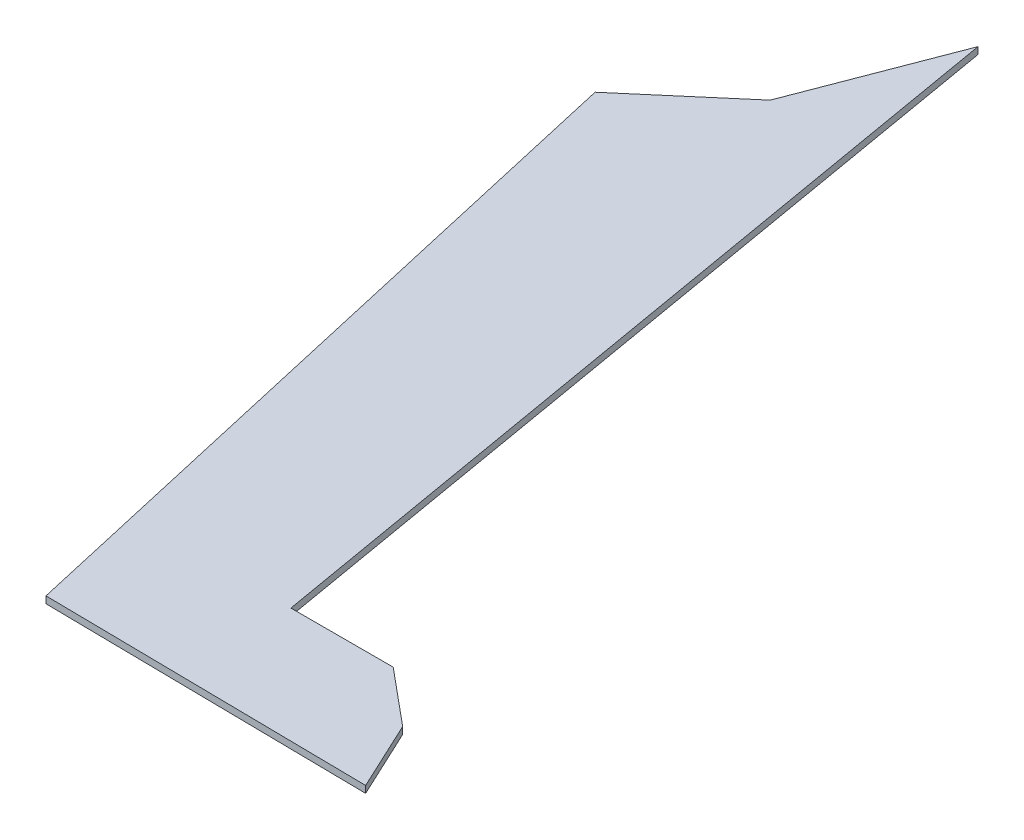
ISO-10303-21;
HEADER;
FILE_DESCRIPTION(('STEP AP214'),'2;1');
FILE_NAME('part.step','',(''),(''),'','','');
FILE_SCHEMA(('AUTOMOTIVE_DESIGN { 1 0 10303 214 1 1 1 1 }'));
ENDSEC;
DATA;
#1=APPLICATION_CONTEXT('core data for automotive mechanical design processes');
#2=APPLICATION_PROTOCOL_DEFINITION('international standard','automotive_design',2000,#1);
#3=PRODUCT_CONTEXT('',#1,'mechanical');
#4=PRODUCT('Part','Part','',(#3));
#5=PRODUCT_RELATED_PRODUCT_CATEGORY('part','',(#4));
#6=PRODUCT_DEFINITION_FORMATION('','',#4);
#7=PRODUCT_DEFINITION_CONTEXT('part definition',#1,'design');
#8=PRODUCT_DEFINITION('design','',#6,#7);
#9=PRODUCT_DEFINITION_SHAPE('','',#8);
#10=(LENGTH_UNIT() NAMED_UNIT(*) SI_UNIT(.MILLI.,.METRE.));
#11=(NAMED_UNIT(*) PLANE_ANGLE_UNIT() SI_UNIT($,.RADIAN.));
#12=(NAMED_UNIT(*) SI_UNIT($,.STERADIAN.) SOLID_ANGLE_UNIT());
#13=UNCERTAINTY_MEASURE_WITH_UNIT(LENGTH_MEASURE(1.E-05),#10,'distance_accuracy_value','');
#14=(GEOMETRIC_REPRESENTATION_CONTEXT(3) GLOBAL_UNCERTAINTY_ASSIGNED_CONTEXT((#13)) GLOBAL_UNIT_ASSIGNED_CONTEXT((#10,
#11,#12)) REPRESENTATION_CONTEXT('',''));
#15=CARTESIAN_POINT('',(0.,0.,0.));
#16=DIRECTION('',(0.,0.,1.));
#17=DIRECTION('',(1.,0.,0.));
#18=AXIS2_PLACEMENT_3D('',#15,#16,#17);
#19=CARTESIAN_POINT('',(84.8611547416434,2.,-18.9767312589499));
#20=DIRECTION('',(-0.639171684388944,0.,0.769064079173771));
#21=DIRECTION('',(0.769064079173771,0.,0.639171684388944));
#22=AXIS2_PLACEMENT_3D('',#19,#20,#21);
#23=PLANE('',#22);
#24=DIRECTION('',(-0.769064079173771,0.,-0.639171684388944));
#25=VECTOR('',#24,1.);
#26=CARTESIAN_POINT('',(84.8611547416434,0.,-18.9767312589499));
#27=LINE('',#26,#25);
#28=CARTESIAN_POINT('',(84.8611547416434,0.,-18.9767312589499));
#29=VERTEX_POINT('',#28);
#30=CARTESIAN_POINT('',(68.5103296907742,0.,-32.5659557097145));
#31=VERTEX_POINT('',#30);
#32=EDGE_CURVE('E140',#29,#31,#27,.T.);
#33=ORIENTED_EDGE('',*,*,#32,.T.);
#34=DIRECTION('',(0.,-1.,0.));
#35=VECTOR('',#34,1.);
#36=CARTESIAN_POINT('',(68.5103296907742,2.,-32.5659557097145));
#37=LINE('',#36,#35);
#38=CARTESIAN_POINT('',(68.5103296907742,2.,-32.5659557097145));
#39=VERTEX_POINT('',#38);
#40=EDGE_CURVE('E11',#39,#31,#37,.T.);
#41=ORIENTED_EDGE('',*,*,#40,.F.);
#42=DIRECTION('',(-0.769064079173771,0.,-0.639171684388944));
#43=VECTOR('',#42,1.);
#44=CARTESIAN_POINT('',(84.8611547416434,2.,-18.9767312589499));
#45=LINE('',#44,#43);
#46=CARTESIAN_POINT('',(84.8611547416434,2.,-18.9767312589499));
#47=VERTEX_POINT('',#46);
#48=EDGE_CURVE('E162',#47,#39,#45,.T.);
#49=ORIENTED_EDGE('',*,*,#48,.F.);
#50=DIRECTION('',(0.,-1.,0.));
#51=VECTOR('',#50,1.);
#52=CARTESIAN_POINT('',(84.8611547416434,2.,-18.9767312589499));
#53=LINE('',#52,#51);
#54=EDGE_CURVE('E136',#47,#29,#53,.T.);
#55=ORIENTED_EDGE('',*,*,#54,.T.);
#56=EDGE_LOOP('',(#33,#41,#49,#55));
#57=FACE_BOUND('',#56,.T.);
#58=ADVANCED_FACE('F39',(#57),#23,.F.);
#59=CARTESIAN_POINT('',(68.5103296907742,2.,-32.5659557097145));
#60=DIRECTION('',(0.,0.,1.));
#61=DIRECTION('',(1.,0.,0.));
#62=AXIS2_PLACEMENT_3D('',#59,#60,#61);
#63=PLANE('',#62);
#64=DIRECTION('',(-1.,0.,0.));
#65=VECTOR('',#64,1.);
#66=CARTESIAN_POINT('',(68.5103296907742,0.,-32.5659557097145));
#67=LINE('',#66,#65);
#68=CARTESIAN_POINT('',(38.7263403193535,0.,-32.5659557097145));
#69=VERTEX_POINT('',#68);
#70=EDGE_CURVE('E144',#31,#69,#67,.T.);
#71=ORIENTED_EDGE('',*,*,#70,.T.);
#72=DIRECTION('',(0.,-1.,0.));
#73=VECTOR('',#72,1.);
#74=CARTESIAN_POINT('',(38.7263403193535,2.,-32.5659557097145));
#75=LINE('',#74,#73);
#76=CARTESIAN_POINT('',(38.7263403193535,2.,-32.5659557097145));
#77=VERTEX_POINT('',#76);
#78=EDGE_CURVE('E48',#77,#69,#75,.T.);
#79=ORIENTED_EDGE('',*,*,#78,.F.);
#80=DIRECTION('',(-1.,0.,0.));
#81=VECTOR('',#80,1.);
#82=CARTESIAN_POINT('',(68.5103296907742,2.,-32.5659557097145));
#83=LINE('',#82,#81);
#84=EDGE_CURVE('E99',#39,#77,#83,.T.);
#85=ORIENTED_EDGE('',*,*,#84,.F.);
#86=ORIENTED_EDGE('',*,*,#40,.T.);
#87=EDGE_LOOP('',(#71,#79,#85,#86));
#88=FACE_BOUND('',#87,.T.);
#89=ADVANCED_FACE('F208',(#88),#63,.F.);
#90=CARTESIAN_POINT('',(38.7263403193535,2.,-32.5659557097145));
#91=DIRECTION('',(-0.985536140125741,0.,0.169465384388838));
#92=DIRECTION('',(0.169465384388838,0.,0.985536140125741));
#93=AXIS2_PLACEMENT_3D('',#90,#91,#92);
#94=PLANE('',#93);
#95=DIRECTION('',(-0.169465384388838,0.,-0.985536140125741));
#96=VECTOR('',#95,1.);
#97=CARTESIAN_POINT('',(38.7263403193535,0.,-32.5659557097145));
#98=LINE('',#97,#96);
#99=CARTESIAN_POINT('',(-2.81215670151834,0.,-274.135584623683));
#100=VERTEX_POINT('',#99);
#101=EDGE_CURVE('E147',#69,#100,#98,.T.);
#102=ORIENTED_EDGE('',*,*,#101,.T.);
#103=DIRECTION('',(0.,-1.,0.));
#104=VECTOR('',#103,1.);
#105=CARTESIAN_POINT('',(-2.81215670151834,2.,-274.135584623683));
#106=LINE('',#105,#104);
#107=CARTESIAN_POINT('',(-2.81215670151834,2.,-274.135584623683));
#108=VERTEX_POINT('',#107);
#109=EDGE_CURVE('E173',#108,#100,#106,.T.);
#110=ORIENTED_EDGE('',*,*,#109,.F.);
#111=DIRECTION('',(-0.169465384388838,0.,-0.985536140125741));
#112=VECTOR('',#111,1.);
#113=CARTESIAN_POINT('',(38.7263403193535,2.,-32.5659557097145));
#114=LINE('',#113,#112);
#115=EDGE_CURVE('E183',#77,#108,#114,.T.);
#116=ORIENTED_EDGE('',*,*,#115,.F.);
#117=ORIENTED_EDGE('',*,*,#78,.T.);
#118=EDGE_LOOP('',(#102,#110,#116,#117));
#119=FACE_BOUND('',#118,.T.);
#120=ADVANCED_FACE('F181',(#119),#94,.F.);
#121=CARTESIAN_POINT('',(-2.81215670151834,2.,-274.135584623683));
#122=DIRECTION('',(0.9338614890941,0.,0.357634896489352));
#123=DIRECTION('',(0.357634896489352,0.,-0.9338614890941));
#124=AXIS2_PLACEMENT_3D('',#121,#122,#123);
#125=PLANE('',#124);
#126=DIRECTION('',(-0.357634896489352,0.,0.933861489094101));
#127=VECTOR('',#126,1.);
#128=CARTESIAN_POINT('',(-2.81215670151834,0.,-274.135584623683));
#129=LINE('',#128,#127);
#130=CARTESIAN_POINT('',(-19.5662351176632,0.,-230.387089240023));
#131=VERTEX_POINT('',#130);
#132=EDGE_CURVE('E150',#100,#131,#129,.T.);
#133=ORIENTED_EDGE('',*,*,#132,.T.);
#134=DIRECTION('',(0.,-1.,0.));
#135=VECTOR('',#134,1.);
#136=CARTESIAN_POINT('',(-19.5662351176632,2.,-230.387089240023));
#137=LINE('',#136,#135);
#138=CARTESIAN_POINT('',(-19.5662351176632,2.,-230.387089240023));
#139=VERTEX_POINT('',#138);
#140=EDGE_CURVE('E169',#139,#131,#137,.T.);
#141=ORIENTED_EDGE('',*,*,#140,.F.);
#142=DIRECTION('',(-0.357634896489352,0.,0.933861489094101));
#143=VECTOR('',#142,1.);
#144=CARTESIAN_POINT('',(-2.81215670151834,2.,-274.135584623683));
#145=LINE('',#144,#143);
#146=EDGE_CURVE('E196',#108,#139,#145,.T.);
#147=ORIENTED_EDGE('',*,*,#146,.F.);
#148=ORIENTED_EDGE('',*,*,#109,.T.);
#149=EDGE_LOOP('',(#133,#141,#147,#148));
#150=FACE_BOUND('',#149,.T.);
#151=ADVANCED_FACE('F191',(#150),#125,.F.);
#152=CARTESIAN_POINT('',(-19.5662351176632,2.,-230.387089240023));
#153=DIRECTION('',(0.649617978151417,0.,0.760260798977867));
#154=DIRECTION('',(0.760260798977867,0.,-0.649617978151417));
#155=AXIS2_PLACEMENT_3D('',#152,#153,#154);
#156=PLANE('',#155);
#157=DIRECTION('',(-0.760260798977867,0.,0.649617978151417));
#158=VECTOR('',#157,1.);
#159=CARTESIAN_POINT('',(-19.5662351176632,0.,-230.387089240023));
#160=LINE('',#159,#158);
#161=CARTESIAN_POINT('',(-47.052202514385,0.,-206.901229398505));
#162=VERTEX_POINT('',#161);
#163=EDGE_CURVE('E153',#131,#162,#160,.T.);
#164=ORIENTED_EDGE('',*,*,#163,.T.);
#165=DIRECTION('',(0.,-1.,0.));
#166=VECTOR('',#165,1.);
#167=CARTESIAN_POINT('',(-47.052202514385,2.,-206.901229398505));
#168=LINE('',#167,#166);
#169=CARTESIAN_POINT('',(-47.052202514385,2.,-206.901229398505));
#170=VERTEX_POINT('',#169);
#171=EDGE_CURVE('E129',#170,#162,#168,.T.);
#172=ORIENTED_EDGE('',*,*,#171,.F.);
#173=DIRECTION('',(-0.760260798977867,0.,0.649617978151417));
#174=VECTOR('',#173,1.);
#175=CARTESIAN_POINT('',(-19.5662351176632,2.,-230.387089240023));
#176=LINE('',#175,#174);
#177=EDGE_CURVE('E118',#139,#170,#176,.T.);
#178=ORIENTED_EDGE('',*,*,#177,.F.);
#179=ORIENTED_EDGE('',*,*,#140,.T.);
#180=EDGE_LOOP('',(#164,#172,#178,#179));
#181=FACE_BOUND('',#180,.T.);
#182=ADVANCED_FACE('F194',(#181),#156,.F.);
#183=CARTESIAN_POINT('',(-47.052202514385,2.,-206.901229398505));
#184=DIRECTION('',(0.975103110966231,0.,-0.221751940203413));
#185=DIRECTION('',(-0.221751940203413,0.,-0.975103110966231));
#186=AXIS2_PLACEMENT_3D('',#183,#184,#185);
#187=PLANE('',#186);
#188=DIRECTION('',(0.221751940203413,0.,0.975103110966231));
#189=VECTOR('',#188,1.);
#190=CARTESIAN_POINT('',(-47.052202514385,0.,-206.901229398505));
#191=LINE('',#190,#189);
#192=CARTESIAN_POINT('',(0.,0.,0.));
#193=VERTEX_POINT('',#192);
#194=EDGE_CURVE('E127',#162,#193,#191,.T.);
#195=ORIENTED_EDGE('',*,*,#194,.T.);
#196=DIRECTION('',(0.,-1.,0.));
#197=VECTOR('',#196,1.);
#198=CARTESIAN_POINT('',(0.,2.,0.));
#199=LINE('',#198,#197);
#200=CARTESIAN_POINT('',(0.,2.,0.));
#201=VERTEX_POINT('',#200);
#202=EDGE_CURVE('E124',#201,#193,#199,.T.);
#203=ORIENTED_EDGE('',*,*,#202,.F.);
#204=DIRECTION('',(0.221751940203413,0.,0.975103110966231));
#205=VECTOR('',#204,1.);
#206=CARTESIAN_POINT('',(-47.052202514385,2.,-206.901229398505));
#207=LINE('',#206,#205);
#208=EDGE_CURVE('E112',#170,#201,#207,.T.);
#209=ORIENTED_EDGE('',*,*,#208,.F.);
#210=ORIENTED_EDGE('',*,*,#171,.T.);
#211=EDGE_LOOP('',(#195,#203,#209,#210));
#212=FACE_BOUND('',#211,.T.);
#213=ADVANCED_FACE('F125',(#212),#187,.F.);
#214=CARTESIAN_POINT('',(0.,2.,0.));
#215=DIRECTION('',(0.0135266599677263,0.,-0.999908510549899));
#216=DIRECTION('',(-0.999908510549899,0.,-0.0135266599677263));
#217=AXIS2_PLACEMENT_3D('',#214,#215,#216);
#218=PLANE('',#217);
#219=DIRECTION('',(0.999908510549899,0.,0.0135266599677263));
#220=VECTOR('',#219,1.);
#221=CARTESIAN_POINT('',(0.,0.,0.));
#222=LINE('',#221,#220);
#223=CARTESIAN_POINT('',(94.3261371990828,0.,1.27603432764004));
#224=VERTEX_POINT('',#223);
#225=EDGE_CURVE('E85',#193,#224,#222,.T.);
#226=ORIENTED_EDGE('',*,*,#225,.T.);
#227=DIRECTION('',(0.,-1.,0.));
#228=VECTOR('',#227,1.);
#229=CARTESIAN_POINT('',(94.3261371990828,2.,1.27603432764004));
#230=LINE('',#229,#228);
#231=CARTESIAN_POINT('',(94.3261371990828,2.,1.27603432764004));
#232=VERTEX_POINT('',#231);
#233=EDGE_CURVE('E130',#232,#224,#230,.T.);
#234=ORIENTED_EDGE('',*,*,#233,.F.);
#235=DIRECTION('',(0.999908510549899,0.,0.0135266599677263));
#236=VECTOR('',#235,1.);
#237=CARTESIAN_POINT('',(0.,2.,0.));
#238=LINE('',#237,#236);
#239=EDGE_CURVE('E116',#201,#232,#238,.T.);
#240=ORIENTED_EDGE('',*,*,#239,.F.);
#241=ORIENTED_EDGE('',*,*,#202,.T.);
#242=EDGE_LOOP('',(#226,#234,#240,#241));
#243=FACE_BOUND('',#242,.T.);
#244=ADVANCED_FACE('F132',(#243),#218,.F.);
#245=CARTESIAN_POINT('',(94.3261371990828,2.,1.27603432764004));
#246=DIRECTION('',(-0.905948296717631,0.,0.423388336724601));
#247=DIRECTION('',(0.423388336724601,0.,0.905948296717631));
#248=AXIS2_PLACEMENT_3D('',#245,#246,#247);
#249=PLANE('',#248);
#250=DIRECTION('',(-0.423388336724601,0.,-0.905948296717631));
#251=VECTOR('',#250,1.);
#252=CARTESIAN_POINT('',(94.3261371990828,0.,1.27603432764004));
#253=LINE('',#252,#251);
#254=EDGE_CURVE('E91',#224,#29,#253,.T.);
#255=ORIENTED_EDGE('',*,*,#254,.T.);
#256=ORIENTED_EDGE('',*,*,#54,.F.);
#257=DIRECTION('',(-0.423388336724601,0.,-0.905948296717631));
#258=VECTOR('',#257,1.);
#259=CARTESIAN_POINT('',(94.3261371990828,2.,1.27603432764004));
#260=LINE('',#259,#258);
#261=EDGE_CURVE('E56',#232,#47,#260,.T.);
#262=ORIENTED_EDGE('',*,*,#261,.F.);
#263=ORIENTED_EDGE('',*,*,#233,.T.);
#264=EDGE_LOOP('',(#255,#256,#262,#263));
#265=FACE_BOUND('',#264,.T.);
#266=ADVANCED_FACE('F224',(#265),#249,.F.);
#267=CARTESIAN_POINT('',(0.,2.,0.));
#268=DIRECTION('',(0.,1.,0.));
#269=DIRECTION('',(0.,0.,1.));
#270=AXIS2_PLACEMENT_3D('',#267,#268,#269);
#271=PLANE('',#270);
#272=ORIENTED_EDGE('',*,*,#48,.T.);
#273=ORIENTED_EDGE('',*,*,#84,.T.);
#274=ORIENTED_EDGE('',*,*,#115,.T.);
#275=ORIENTED_EDGE('',*,*,#146,.T.);
#276=ORIENTED_EDGE('',*,*,#177,.T.);
#277=ORIENTED_EDGE('',*,*,#208,.T.);
#278=ORIENTED_EDGE('',*,*,#239,.T.);
#279=ORIENTED_EDGE('',*,*,#261,.T.);
#280=EDGE_LOOP('',(#272,#273,#274,#275,#276,#277,#278,#279));
#281=FACE_BOUND('',#280,.T.);
#282=ADVANCED_FACE('F114',(#281),#271,.T.);
#283=CARTESIAN_POINT('',(0.,0.,0.));
#284=DIRECTION('',(0.,1.,0.));
#285=DIRECTION('',(0.,0.,1.));
#286=AXIS2_PLACEMENT_3D('',#283,#284,#285);
#287=PLANE('',#286);
#288=ORIENTED_EDGE('',*,*,#32,.F.);
#289=ORIENTED_EDGE('',*,*,#254,.F.);
#290=ORIENTED_EDGE('',*,*,#225,.F.);
#291=ORIENTED_EDGE('',*,*,#194,.F.);
#292=ORIENTED_EDGE('',*,*,#163,.F.);
#293=ORIENTED_EDGE('',*,*,#132,.F.);
#294=ORIENTED_EDGE('',*,*,#101,.F.);
#295=ORIENTED_EDGE('',*,*,#70,.F.);
#296=EDGE_LOOP('',(#288,#289,#290,#291,#292,#293,#294,#295));
#297=FACE_BOUND('',#296,.T.);
#298=ADVANCED_FACE('F187',(#297),#287,.F.);
#299=CLOSED_SHELL('',(#58,#89,#120,#151,#182,#213,#244,#266,#282,#298));
#300=MANIFOLD_SOLID_BREP('B2',#299);
#301=ADVANCED_BREP_SHAPE_REPRESENTATION('',(#18,#300),#14);
#302=SHAPE_DEFINITION_REPRESENTATION(#9,#301);
ENDSEC;
END-ISO-10303-21;
